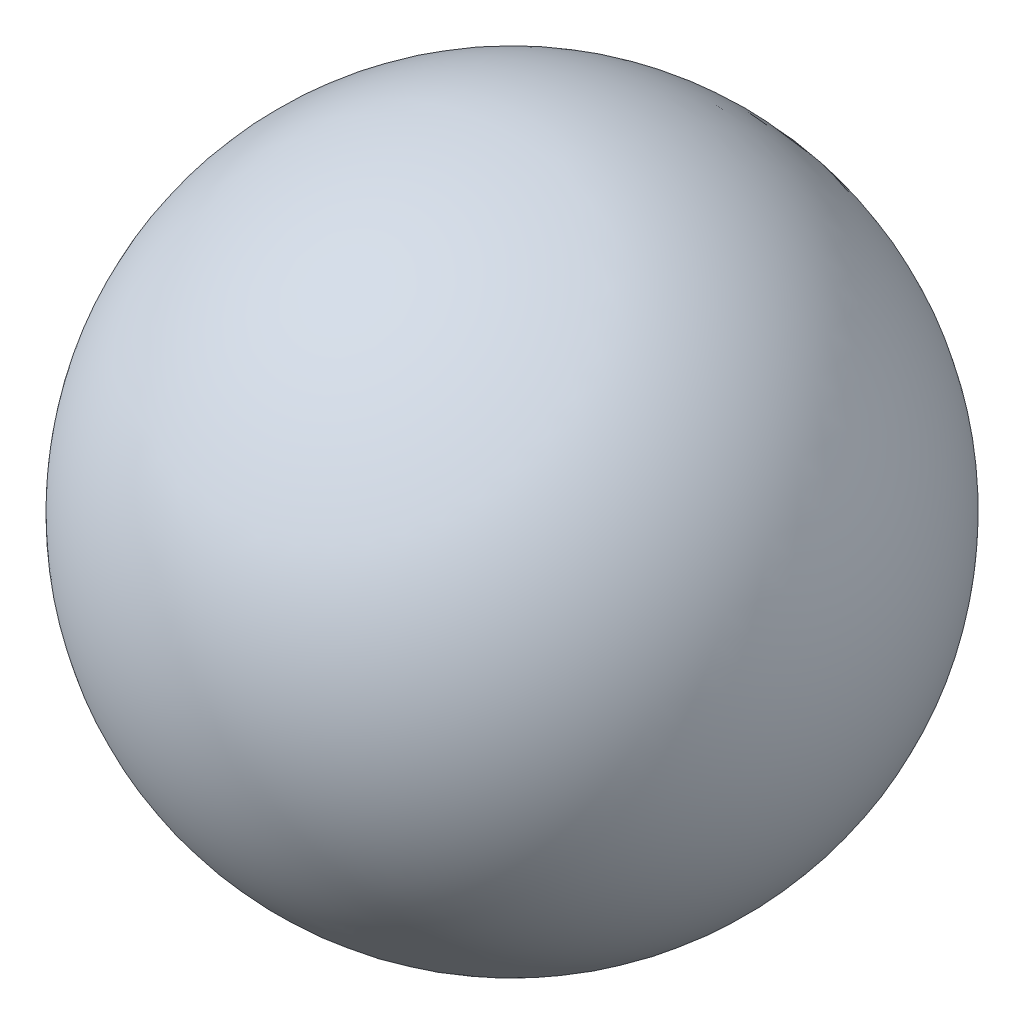
ISO-10303-21;
HEADER;
FILE_DESCRIPTION(('STEP AP214'),'2;1');
FILE_NAME('part.step','',(''),(''),'','','');
FILE_SCHEMA(('AUTOMOTIVE_DESIGN { 1 0 10303 214 1 1 1 1 }'));
ENDSEC;
DATA;
#1=APPLICATION_CONTEXT('core data for automotive mechanical design processes');
#2=APPLICATION_PROTOCOL_DEFINITION('international standard','automotive_design',2000,#1);
#3=PRODUCT_CONTEXT('',#1,'mechanical');
#4=PRODUCT('Part','Part','',(#3));
#5=PRODUCT_RELATED_PRODUCT_CATEGORY('part','',(#4));
#6=PRODUCT_DEFINITION_FORMATION('','',#4);
#7=PRODUCT_DEFINITION_CONTEXT('part definition',#1,'design');
#8=PRODUCT_DEFINITION('design','',#6,#7);
#9=PRODUCT_DEFINITION_SHAPE('','',#8);
#10=(LENGTH_UNIT() NAMED_UNIT(*) SI_UNIT(.MILLI.,.METRE.));
#11=(NAMED_UNIT(*) PLANE_ANGLE_UNIT() SI_UNIT($,.RADIAN.));
#12=(NAMED_UNIT(*) SI_UNIT($,.STERADIAN.) SOLID_ANGLE_UNIT());
#13=UNCERTAINTY_MEASURE_WITH_UNIT(LENGTH_MEASURE(1.E-05),#10,'distance_accuracy_value','');
#14=(GEOMETRIC_REPRESENTATION_CONTEXT(3) GLOBAL_UNCERTAINTY_ASSIGNED_CONTEXT((#13)) GLOBAL_UNIT_ASSIGNED_CONTEXT((#10,
#11,#12)) REPRESENTATION_CONTEXT('',''));
#15=CARTESIAN_POINT('',(0.,0.,0.));
#16=DIRECTION('',(0.,0.,1.));
#17=DIRECTION('',(1.,0.,0.));
#18=AXIS2_PLACEMENT_3D('',#15,#16,#17);
#19=CARTESIAN_POINT('',(49.75,-27.1414703101188,-45.5223855883557));
#20=DIRECTION('',(0.,-0.512108044606437,-0.85892103865802));
#21=DIRECTION('',(0.173648177666934,0.845872098095716,-0.504327972708341));
#22=AXIS2_PLACEMENT_3D('',#19,#20,#21);
#23=SPHERICAL_SURFACE('',#22,5.95);
#24=CARTESIAN_POINT('',(49.75,-24.0944274447105,-40.4118054083405));
#25=VERTEX_POINT('',#24);
#26=VERTEX_LOOP('',#25);
#27=FACE_BOUND('',#26,.T.);
#28=CARTESIAN_POINT('',(49.75,-30.1885131755271,-50.6329657683709));
#29=VERTEX_POINT('',#28);
#30=VERTEX_LOOP('',#29);
#31=FACE_BOUND('',#30,.T.);
#32=ADVANCED_FACE('F16',(#27,#31),#23,.T.);
#33=CLOSED_SHELL('',(#32));
#34=MANIFOLD_SOLID_BREP('B1',#33);
#35=ADVANCED_BREP_SHAPE_REPRESENTATION('',(#18,#34),#14);
#36=SHAPE_DEFINITION_REPRESENTATION(#9,#35);
ENDSEC;
END-ISO-10303-21;
